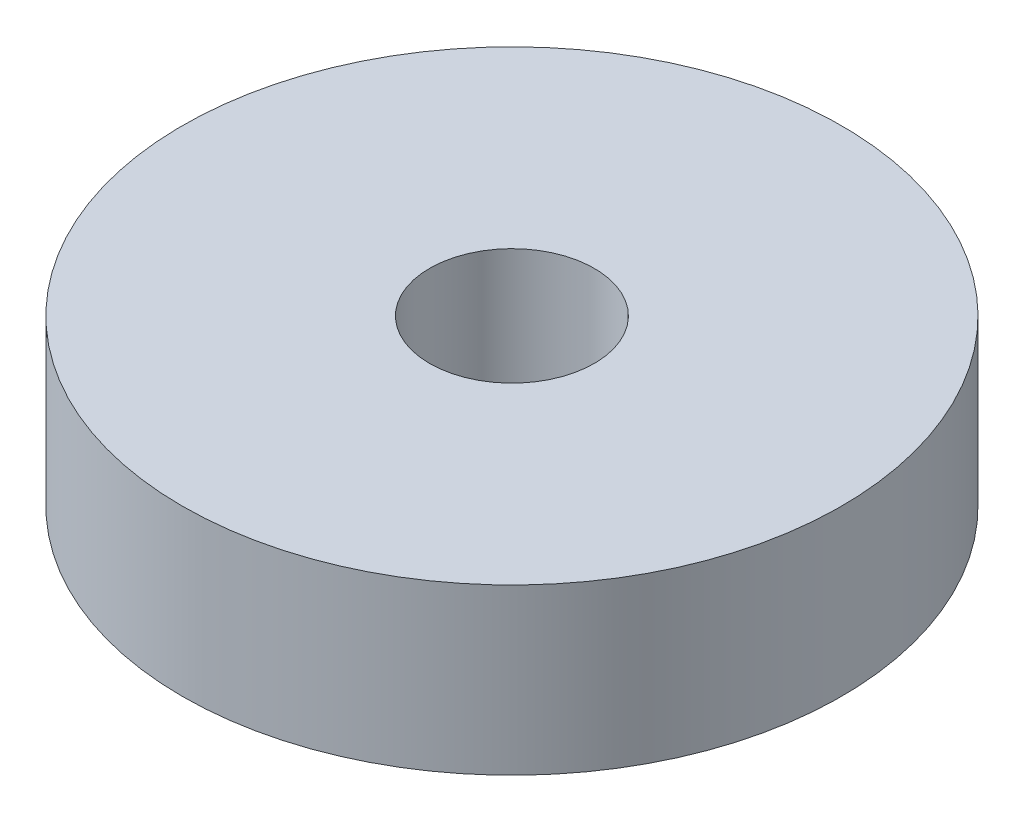
ISO-10303-21;
HEADER;
FILE_DESCRIPTION(('STEP AP214'),'2;1');
FILE_NAME('part.step','',(''),(''),'','','');
FILE_SCHEMA(('AUTOMOTIVE_DESIGN { 1 0 10303 214 1 1 1 1 }'));
ENDSEC;
DATA;
#1=APPLICATION_CONTEXT('core data for automotive mechanical design processes');
#2=APPLICATION_PROTOCOL_DEFINITION('international standard','automotive_design',2000,#1);
#3=PRODUCT_CONTEXT('',#1,'mechanical');
#4=PRODUCT('Part','Part','',(#3));
#5=PRODUCT_RELATED_PRODUCT_CATEGORY('part','',(#4));
#6=PRODUCT_DEFINITION_FORMATION('','',#4);
#7=PRODUCT_DEFINITION_CONTEXT('part definition',#1,'design');
#8=PRODUCT_DEFINITION('design','',#6,#7);
#9=PRODUCT_DEFINITION_SHAPE('','',#8);
#10=(LENGTH_UNIT() NAMED_UNIT(*) SI_UNIT(.MILLI.,.METRE.));
#11=(NAMED_UNIT(*) PLANE_ANGLE_UNIT() SI_UNIT($,.RADIAN.));
#12=(NAMED_UNIT(*) SI_UNIT($,.STERADIAN.) SOLID_ANGLE_UNIT());
#13=UNCERTAINTY_MEASURE_WITH_UNIT(LENGTH_MEASURE(1.E-05),#10,'distance_accuracy_value','');
#14=(GEOMETRIC_REPRESENTATION_CONTEXT(3) GLOBAL_UNCERTAINTY_ASSIGNED_CONTEXT((#13)) GLOBAL_UNIT_ASSIGNED_CONTEXT((#10,
#11,#12)) REPRESENTATION_CONTEXT('',''));
#15=CARTESIAN_POINT('',(0.,0.,0.));
#16=DIRECTION('',(0.,0.,1.));
#17=DIRECTION('',(1.,0.,0.));
#18=AXIS2_PLACEMENT_3D('',#15,#16,#17);
#19=CARTESIAN_POINT('',(0.,3.,0.));
#20=DIRECTION('',(0.,1.,0.));
#21=DIRECTION('',(0.,0.,1.));
#22=AXIS2_PLACEMENT_3D('',#19,#20,#21);
#23=PLANE('',#22);
#24=CARTESIAN_POINT('',(0.,3.,0.));
#25=DIRECTION('',(0.,1.,0.));
#26=DIRECTION('',(0.,0.,1.));
#27=AXIS2_PLACEMENT_3D('',#24,#25,#26);
#28=CIRCLE('',#27,6.);
#29=CARTESIAN_POINT('',(0.,3.,6.));
#30=VERTEX_POINT('',#29);
#31=EDGE_CURVE('E10',#30,#30,#28,.T.);
#32=ORIENTED_EDGE('',*,*,#31,.T.);
#33=EDGE_LOOP('',(#32));
#34=FACE_BOUND('',#33,.T.);
#35=CARTESIAN_POINT('',(0.,3.,0.));
#36=DIRECTION('',(0.,1.,0.));
#37=DIRECTION('',(0.,0.,1.));
#38=AXIS2_PLACEMENT_3D('',#35,#36,#37);
#39=CIRCLE('',#38,1.5);
#40=CARTESIAN_POINT('',(0.,3.,1.5));
#41=VERTEX_POINT('',#40);
#42=EDGE_CURVE('E42',#41,#41,#39,.T.);
#43=ORIENTED_EDGE('',*,*,#42,.F.);
#44=EDGE_LOOP('',(#43));
#45=FACE_BOUND('',#44,.T.);
#46=ADVANCED_FACE('F31',(#34,#45),#23,.T.);
#47=CARTESIAN_POINT('',(0.,0.,0.));
#48=DIRECTION('',(0.,1.,0.));
#49=DIRECTION('',(0.,0.,1.));
#50=AXIS2_PLACEMENT_3D('',#47,#48,#49);
#51=PLANE('',#50);
#52=CARTESIAN_POINT('',(0.,0.,0.));
#53=DIRECTION('',(0.,1.,0.));
#54=DIRECTION('',(0.,0.,1.));
#55=AXIS2_PLACEMENT_3D('',#52,#53,#54);
#56=CIRCLE('',#55,6.);
#57=CARTESIAN_POINT('',(0.,0.,6.));
#58=VERTEX_POINT('',#57);
#59=EDGE_CURVE('E35',#58,#58,#56,.T.);
#60=ORIENTED_EDGE('',*,*,#59,.F.);
#61=EDGE_LOOP('',(#60));
#62=FACE_BOUND('',#61,.T.);
#63=CARTESIAN_POINT('',(0.,0.,0.));
#64=DIRECTION('',(0.,1.,0.));
#65=DIRECTION('',(0.,0.,1.));
#66=AXIS2_PLACEMENT_3D('',#63,#64,#65);
#67=CIRCLE('',#66,1.5);
#68=CARTESIAN_POINT('',(0.,0.,1.5));
#69=VERTEX_POINT('',#68);
#70=EDGE_CURVE('E44',#69,#69,#67,.T.);
#71=ORIENTED_EDGE('',*,*,#70,.T.);
#72=EDGE_LOOP('',(#71));
#73=FACE_BOUND('',#72,.T.);
#74=ADVANCED_FACE('F54',(#62,#73),#51,.F.);
#75=CARTESIAN_POINT('',(0.,3.,0.));
#76=DIRECTION('',(0.,-1.,0.));
#77=DIRECTION('',(0.,0.,-1.));
#78=AXIS2_PLACEMENT_3D('',#75,#76,#77);
#79=CYLINDRICAL_SURFACE('',#78,6.);
#80=ORIENTED_EDGE('',*,*,#31,.F.);
#81=EDGE_LOOP('',(#80));
#82=FACE_BOUND('',#81,.T.);
#83=ORIENTED_EDGE('',*,*,#59,.T.);
#84=EDGE_LOOP('',(#83));
#85=FACE_BOUND('',#84,.T.);
#86=ADVANCED_FACE('F33',(#82,#85),#79,.T.);
#87=CARTESIAN_POINT('',(0.,3.,0.));
#88=DIRECTION('',(0.,-1.,0.));
#89=DIRECTION('',(0.,0.,-1.));
#90=AXIS2_PLACEMENT_3D('',#87,#88,#89);
#91=CYLINDRICAL_SURFACE('',#90,1.5);
#92=ORIENTED_EDGE('',*,*,#42,.T.);
#93=EDGE_LOOP('',(#92));
#94=FACE_BOUND('',#93,.T.);
#95=ORIENTED_EDGE('',*,*,#70,.F.);
#96=EDGE_LOOP('',(#95));
#97=FACE_BOUND('',#96,.T.);
#98=ADVANCED_FACE('F50',(#94,#97),#91,.F.);
#99=CLOSED_SHELL('',(#46,#74,#86,#98));
#100=MANIFOLD_SOLID_BREP('B2',#99);
#101=ADVANCED_BREP_SHAPE_REPRESENTATION('',(#18,#100),#14);
#102=SHAPE_DEFINITION_REPRESENTATION(#9,#101);
ENDSEC;
END-ISO-10303-21;
